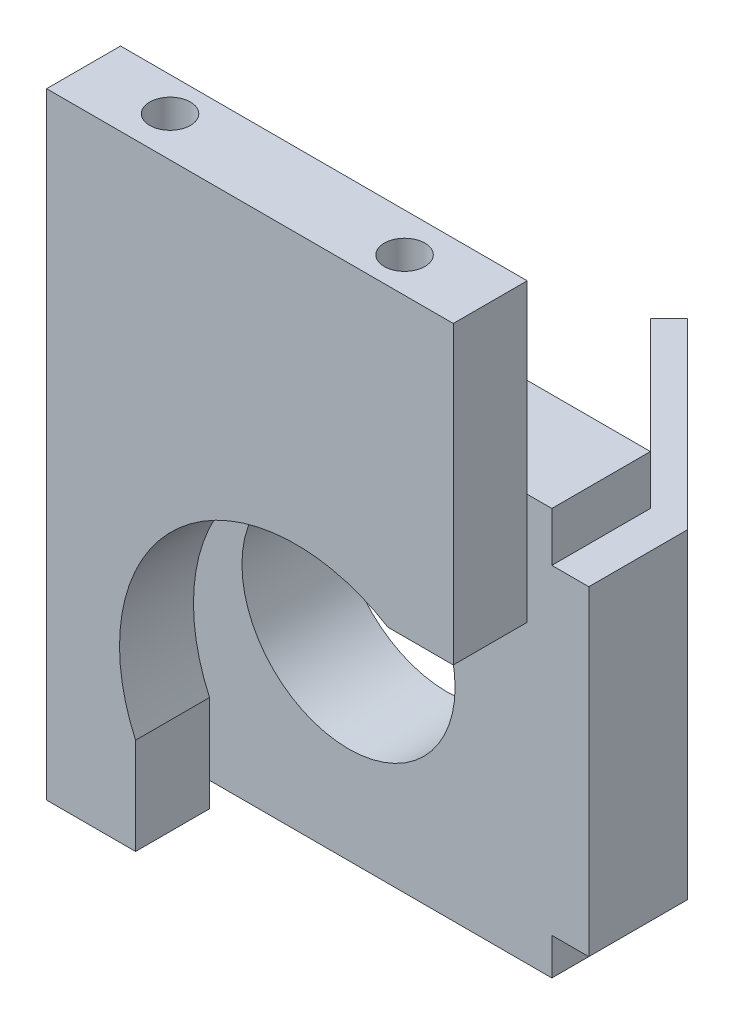
ISO-10303-21;
HEADER;
FILE_DESCRIPTION(('STEP AP214'),'2;1');
FILE_NAME('part.step','',(''),(''),'','','');
FILE_SCHEMA(('AUTOMOTIVE_DESIGN { 1 0 10303 214 1 1 1 1 }'));
ENDSEC;
DATA;
#1=APPLICATION_CONTEXT('core data for automotive mechanical design processes');
#2=APPLICATION_PROTOCOL_DEFINITION('international standard','automotive_design',2000,#1);
#3=PRODUCT_CONTEXT('',#1,'mechanical');
#4=PRODUCT('Part','Part','',(#3));
#5=PRODUCT_RELATED_PRODUCT_CATEGORY('part','',(#4));
#6=PRODUCT_DEFINITION_FORMATION('','',#4);
#7=PRODUCT_DEFINITION_CONTEXT('part definition',#1,'design');
#8=PRODUCT_DEFINITION('design','',#6,#7);
#9=PRODUCT_DEFINITION_SHAPE('','',#8);
#10=(LENGTH_UNIT() NAMED_UNIT(*) SI_UNIT(.MILLI.,.METRE.));
#11=(NAMED_UNIT(*) PLANE_ANGLE_UNIT() SI_UNIT($,.RADIAN.));
#12=(NAMED_UNIT(*) SI_UNIT($,.STERADIAN.) SOLID_ANGLE_UNIT());
#13=UNCERTAINTY_MEASURE_WITH_UNIT(LENGTH_MEASURE(1.E-05),#10,'distance_accuracy_value','');
#14=(GEOMETRIC_REPRESENTATION_CONTEXT(3) GLOBAL_UNCERTAINTY_ASSIGNED_CONTEXT((#13)) GLOBAL_UNIT_ASSIGNED_CONTEXT((#10,
#11,#12)) REPRESENTATION_CONTEXT('',''));
#15=CARTESIAN_POINT('',(0.,0.,0.));
#16=DIRECTION('',(0.,0.,1.));
#17=DIRECTION('',(1.,0.,0.));
#18=AXIS2_PLACEMENT_3D('',#15,#16,#17);
#19=CARTESIAN_POINT('',(0.,0.,0.));
#20=DIRECTION('',(0.,0.,-1.));
#21=DIRECTION('',(-1.,0.,0.));
#22=AXIS2_PLACEMENT_3D('',#19,#20,#21);
#23=PLANE('',#22);
#24=CARTESIAN_POINT('',(16.5,16.5,0.));
#25=DIRECTION('',(0.,0.,1.));
#26=DIRECTION('',(1.,0.,0.));
#27=AXIS2_PLACEMENT_3D('',#24,#25,#26);
#28=CIRCLE('',#27,8.65);
#29=CARTESIAN_POINT('',(25.15,16.5,0.));
#30=VERTEX_POINT('',#29);
#31=EDGE_CURVE('E248',#30,#30,#28,.T.);
#32=ORIENTED_EDGE('',*,*,#31,.T.);
#33=EDGE_LOOP('',(#32));
#34=FACE_BOUND('',#33,.T.);
#35=DIRECTION('',(0.,1.,0.));
#36=VECTOR('',#35,1.);
#37=CARTESIAN_POINT('',(33.,0.,0.));
#38=LINE('',#37,#36);
#39=CARTESIAN_POINT('',(33.,29.,0.));
#40=VERTEX_POINT('',#39);
#41=CARTESIAN_POINT('',(33.,33.,0.));
#42=VERTEX_POINT('',#41);
#43=EDGE_CURVE('E270',#40,#42,#38,.T.);
#44=ORIENTED_EDGE('',*,*,#43,.F.);
#45=DIRECTION('',(0.,-1.,0.));
#46=VECTOR('',#45,1.);
#47=CARTESIAN_POINT('',(33.,0.,0.));
#48=LINE('',#47,#46);
#49=CARTESIAN_POINT('',(33.,3.,0.));
#50=VERTEX_POINT('',#49);
#51=EDGE_CURVE('E219',#40,#50,#48,.T.);
#52=ORIENTED_EDGE('',*,*,#51,.T.);
#53=CARTESIAN_POINT('',(33.,0.,0.));
#54=VERTEX_POINT('',#53);
#55=EDGE_CURVE('E271',#54,#50,#38,.T.);
#56=ORIENTED_EDGE('',*,*,#55,.F.);
#57=DIRECTION('',(1.,0.,0.));
#58=VECTOR('',#57,1.);
#59=CARTESIAN_POINT('',(0.,0.,0.));
#60=LINE('',#59,#58);
#61=CARTESIAN_POINT('',(0.,0.,0.));
#62=VERTEX_POINT('',#61);
#63=EDGE_CURVE('E268',#62,#54,#60,.T.);
#64=ORIENTED_EDGE('',*,*,#63,.F.);
#65=DIRECTION('',(0.,-1.,0.));
#66=VECTOR('',#65,1.);
#67=CARTESIAN_POINT('',(0.,0.,0.));
#68=LINE('',#67,#66);
#69=CARTESIAN_POINT('',(0.,33.,0.));
#70=VERTEX_POINT('',#69);
#71=EDGE_CURVE('E252',#70,#62,#68,.T.);
#72=ORIENTED_EDGE('',*,*,#71,.F.);
#73=DIRECTION('',(-1.,0.,0.));
#74=VECTOR('',#73,1.);
#75=CARTESIAN_POINT('',(0.,33.,0.));
#76=LINE('',#75,#74);
#77=EDGE_CURVE('E259',#42,#70,#76,.T.);
#78=ORIENTED_EDGE('',*,*,#77,.F.);
#79=EDGE_LOOP('',(#44,#52,#56,#64,#72,#78));
#80=FACE_BOUND('',#79,.T.);
#81=ADVANCED_FACE('F34',(#34,#80),#23,.T.);
#82=CARTESIAN_POINT('',(33.,0.,8.));
#83=DIRECTION('',(-1.,0.,0.));
#84=DIRECTION('',(0.,0.,1.));
#85=AXIS2_PLACEMENT_3D('',#82,#83,#84);
#86=PLANE('',#85);
#87=DIRECTION('',(0.,0.,1.));
#88=VECTOR('',#87,1.);
#89=CARTESIAN_POINT('',(33.,29.,8.));
#90=LINE('',#89,#88);
#91=CARTESIAN_POINT('',(33.,29.,8.));
#92=VERTEX_POINT('',#91);
#93=EDGE_CURVE('E228',#40,#92,#90,.T.);
#94=ORIENTED_EDGE('',*,*,#93,.F.);
#95=ORIENTED_EDGE('',*,*,#43,.T.);
#96=DIRECTION('',(0.,0.,-1.));
#97=VECTOR('',#96,1.);
#98=CARTESIAN_POINT('',(33.,33.,8.));
#99=LINE('',#98,#97);
#100=CARTESIAN_POINT('',(33.,33.,8.));
#101=VERTEX_POINT('',#100);
#102=EDGE_CURVE('E276',#101,#42,#99,.T.);
#103=ORIENTED_EDGE('',*,*,#102,.F.);
#104=DIRECTION('',(0.,1.,0.));
#105=VECTOR('',#104,1.);
#106=CARTESIAN_POINT('',(33.,0.,8.));
#107=LINE('',#106,#105);
#108=EDGE_CURVE('E49',#92,#101,#107,.T.);
#109=ORIENTED_EDGE('',*,*,#108,.F.);
#110=EDGE_LOOP('',(#94,#95,#103,#109));
#111=FACE_BOUND('',#110,.T.);
#112=ADVANCED_FACE('F309',(#111),#86,.F.);
#113=DIRECTION('',(0.,0.,-1.));
#114=VECTOR('',#113,1.);
#115=CARTESIAN_POINT('',(33.,3.,8.));
#116=LINE('',#115,#114);
#117=CARTESIAN_POINT('',(33.,3.,8.));
#118=VERTEX_POINT('',#117);
#119=EDGE_CURVE('E57',#118,#50,#116,.T.);
#120=ORIENTED_EDGE('',*,*,#119,.F.);
#121=CARTESIAN_POINT('',(33.,0.,8.));
#122=VERTEX_POINT('',#121);
#123=EDGE_CURVE('E261',#122,#118,#107,.T.);
#124=ORIENTED_EDGE('',*,*,#123,.F.);
#125=DIRECTION('',(0.,0.,-1.));
#126=VECTOR('',#125,1.);
#127=CARTESIAN_POINT('',(33.,0.,8.));
#128=LINE('',#127,#126);
#129=EDGE_CURVE('E279',#122,#54,#128,.T.);
#130=ORIENTED_EDGE('',*,*,#129,.T.);
#131=ORIENTED_EDGE('',*,*,#55,.T.);
#132=EDGE_LOOP('',(#120,#124,#130,#131));
#133=FACE_BOUND('',#132,.T.);
#134=ADVANCED_FACE('F295',(#133),#86,.F.);
#135=CARTESIAN_POINT('',(0.,0.,8.));
#136=DIRECTION('',(0.,0.,-1.));
#137=DIRECTION('',(-1.,0.,0.));
#138=AXIS2_PLACEMENT_3D('',#135,#136,#137);
#139=PLANE('',#138);
#140=CARTESIAN_POINT('',(2.5,30.5,8.));
#141=DIRECTION('',(0.,0.,-1.));
#142=DIRECTION('',(-1.,0.,0.));
#143=AXIS2_PLACEMENT_3D('',#140,#141,#142);
#144=CIRCLE('',#143,1.5);
#145=CARTESIAN_POINT('',(1.,30.5,8.));
#146=VERTEX_POINT('',#145);
#147=EDGE_CURVE('E11',#146,#146,#144,.F.);
#148=ORIENTED_EDGE('',*,*,#147,.F.);
#149=EDGE_LOOP('',(#148));
#150=FACE_BOUND('',#149,.T.);
#151=DIRECTION('',(0.,-1.,0.));
#152=VECTOR('',#151,1.);
#153=CARTESIAN_POINT('',(0.,0.,8.));
#154=LINE('',#153,#152);
#155=CARTESIAN_POINT('',(0.,33.,8.));
#156=VERTEX_POINT('',#155);
#157=CARTESIAN_POINT('',(0.,0.,8.));
#158=VERTEX_POINT('',#157);
#159=EDGE_CURVE('E255',#156,#158,#154,.T.);
#160=ORIENTED_EDGE('',*,*,#159,.T.);
#161=DIRECTION('',(1.,0.,0.));
#162=VECTOR('',#161,1.);
#163=CARTESIAN_POINT('',(0.,0.,8.));
#164=LINE('',#163,#162);
#165=EDGE_CURVE('E258',#158,#122,#164,.T.);
#166=ORIENTED_EDGE('',*,*,#165,.T.);
#167=ORIENTED_EDGE('',*,*,#123,.T.);
#168=DIRECTION('',(-1.,0.,0.));
#169=VECTOR('',#168,1.);
#170=CARTESIAN_POINT('',(36.,3.,8.));
#171=LINE('',#170,#169);
#172=CARTESIAN_POINT('',(36.,3.,8.));
#173=VERTEX_POINT('',#172);
#174=EDGE_CURVE('E245',#173,#118,#171,.T.);
#175=ORIENTED_EDGE('',*,*,#174,.F.);
#176=DIRECTION('',(0.,-1.,0.));
#177=VECTOR('',#176,1.);
#178=CARTESIAN_POINT('',(36.,3.,8.));
#179=LINE('',#178,#177);
#180=CARTESIAN_POINT('',(36.,29.,8.));
#181=VERTEX_POINT('',#180);
#182=EDGE_CURVE('E224',#181,#173,#179,.T.);
#183=ORIENTED_EDGE('',*,*,#182,.F.);
#184=DIRECTION('',(-1.,0.,0.));
#185=VECTOR('',#184,1.);
#186=CARTESIAN_POINT('',(36.,29.,8.));
#187=LINE('',#186,#185);
#188=EDGE_CURVE('E234',#181,#92,#187,.T.);
#189=ORIENTED_EDGE('',*,*,#188,.T.);
#190=ORIENTED_EDGE('',*,*,#108,.T.);
#191=DIRECTION('',(-1.,0.,0.));
#192=VECTOR('',#191,1.);
#193=CARTESIAN_POINT('',(0.,33.,8.));
#194=LINE('',#193,#192);
#195=EDGE_CURVE('E263',#101,#156,#194,.T.);
#196=ORIENTED_EDGE('',*,*,#195,.T.);
#197=EDGE_LOOP('',(#160,#166,#167,#175,#183,#189,#190,#196));
#198=FACE_BOUND('',#197,.T.);
#199=CARTESIAN_POINT('',(16.5,16.5,8.));
#200=DIRECTION('',(0.,0.,1.));
#201=DIRECTION('',(1.,0.,0.));
#202=AXIS2_PLACEMENT_3D('',#199,#200,#201);
#203=CIRCLE('',#202,8.65);
#204=CARTESIAN_POINT('',(25.15,16.5,8.));
#205=VERTEX_POINT('',#204);
#206=EDGE_CURVE('E249',#205,#205,#203,.T.);
#207=ORIENTED_EDGE('',*,*,#206,.F.);
#208=EDGE_LOOP('',(#207));
#209=FACE_BOUND('',#208,.T.);
#210=ADVANCED_FACE('F304',(#150,#198,#209),#139,.F.);
#211=DIRECTION('',(0.,-1.,0.));
#212=VECTOR('',#211,1.);
#213=CARTESIAN_POINT('',(35.998132752231,0.,0.));
#214=LINE('',#213,#212);
#215=CARTESIAN_POINT('',(35.998132752231,29.,0.));
#216=VERTEX_POINT('',#215);
#217=CARTESIAN_POINT('',(35.998132752231,3.,0.));
#218=VERTEX_POINT('',#217);
#219=EDGE_CURVE('E222',#216,#218,#214,.T.);
#220=ORIENTED_EDGE('',*,*,#219,.F.);
#221=DIRECTION('',(-1.,0.,0.));
#222=VECTOR('',#221,1.);
#223=CARTESIAN_POINT('',(36.,29.,0.));
#224=LINE('',#223,#222);
#225=CARTESIAN_POINT('',(36.,29.,0.));
#226=VERTEX_POINT('',#225);
#227=EDGE_CURVE('E239',#226,#216,#224,.T.);
#228=ORIENTED_EDGE('',*,*,#227,.F.);
#229=DIRECTION('',(0.,1.,0.));
#230=VECTOR('',#229,1.);
#231=CARTESIAN_POINT('',(36.,3.,0.));
#232=LINE('',#231,#230);
#233=CARTESIAN_POINT('',(36.,3.,0.));
#234=VERTEX_POINT('',#233);
#235=EDGE_CURVE('E230',#234,#226,#232,.T.);
#236=ORIENTED_EDGE('',*,*,#235,.F.);
#237=DIRECTION('',(-1.,0.,0.));
#238=VECTOR('',#237,1.);
#239=CARTESIAN_POINT('',(36.,3.,0.));
#240=LINE('',#239,#238);
#241=EDGE_CURVE('E242',#234,#218,#240,.T.);
#242=ORIENTED_EDGE('',*,*,#241,.T.);
#243=EDGE_LOOP('',(#220,#228,#236,#242));
#244=FACE_BOUND('',#243,.T.);
#245=ADVANCED_FACE('F328',(#244),#23,.T.);
#246=CARTESIAN_POINT('',(0.,0.,8.));
#247=DIRECTION('',(1.,0.,0.));
#248=DIRECTION('',(0.,0.,-1.));
#249=AXIS2_PLACEMENT_3D('',#246,#247,#248);
#250=PLANE('',#249);
#251=ORIENTED_EDGE('',*,*,#71,.T.);
#252=DIRECTION('',(0.,0.,-1.));
#253=VECTOR('',#252,1.);
#254=CARTESIAN_POINT('',(0.,0.,8.));
#255=LINE('',#254,#253);
#256=EDGE_CURVE('E42',#158,#62,#255,.T.);
#257=ORIENTED_EDGE('',*,*,#256,.F.);
#258=ORIENTED_EDGE('',*,*,#159,.F.);
#259=DIRECTION('',(0.,0.,-1.));
#260=VECTOR('',#259,1.);
#261=CARTESIAN_POINT('',(0.,33.,8.));
#262=LINE('',#261,#260);
#263=EDGE_CURVE('E265',#156,#70,#262,.T.);
#264=ORIENTED_EDGE('',*,*,#263,.T.);
#265=EDGE_LOOP('',(#251,#257,#258,#264));
#266=FACE_BOUND('',#265,.T.);
#267=ADVANCED_FACE('F36',(#266),#250,.F.);
#268=CARTESIAN_POINT('',(0.,0.,8.));
#269=DIRECTION('',(0.,1.,0.));
#270=DIRECTION('',(0.,0.,1.));
#271=AXIS2_PLACEMENT_3D('',#268,#269,#270);
#272=PLANE('',#271);
#273=ORIENTED_EDGE('',*,*,#63,.T.);
#274=ORIENTED_EDGE('',*,*,#129,.F.);
#275=ORIENTED_EDGE('',*,*,#165,.F.);
#276=ORIENTED_EDGE('',*,*,#256,.T.);
#277=EDGE_LOOP('',(#273,#274,#275,#276));
#278=FACE_BOUND('',#277,.T.);
#279=ADVANCED_FACE('F284',(#278),#272,.F.);
#280=CARTESIAN_POINT('',(0.,33.,8.));
#281=DIRECTION('',(0.,-1.,0.));
#282=DIRECTION('',(0.,0.,-1.));
#283=AXIS2_PLACEMENT_3D('',#280,#281,#282);
#284=PLANE('',#283);
#285=ORIENTED_EDGE('',*,*,#77,.T.);
#286=ORIENTED_EDGE('',*,*,#263,.F.);
#287=ORIENTED_EDGE('',*,*,#195,.F.);
#288=ORIENTED_EDGE('',*,*,#102,.T.);
#289=EDGE_LOOP('',(#285,#286,#287,#288));
#290=FACE_BOUND('',#289,.T.);
#291=ADVANCED_FACE('F308',(#290),#284,.F.);
#292=CARTESIAN_POINT('',(16.5,16.5,8.));
#293=DIRECTION('',(0.,0.,-1.));
#294=DIRECTION('',(-1.,0.,0.));
#295=AXIS2_PLACEMENT_3D('',#292,#293,#294);
#296=CYLINDRICAL_SURFACE('',#295,8.65);
#297=ORIENTED_EDGE('',*,*,#206,.T.);
#298=EDGE_LOOP('',(#297));
#299=FACE_BOUND('',#298,.T.);
#300=ORIENTED_EDGE('',*,*,#31,.F.);
#301=EDGE_LOOP('',(#300));
#302=FACE_BOUND('',#301,.T.);
#303=ADVANCED_FACE('F370',(#299,#302),#296,.F.);
#304=CARTESIAN_POINT('',(36.,3.,8.));
#305=DIRECTION('',(0.,1.,0.));
#306=DIRECTION('',(0.,0.,1.));
#307=AXIS2_PLACEMENT_3D('',#304,#305,#306);
#308=PLANE('',#307);
#309=ORIENTED_EDGE('',*,*,#119,.T.);
#310=DIRECTION('',(-0.707106781186551,0.,-0.707106781186544));
#311=VECTOR('',#310,1.);
#312=CARTESIAN_POINT('',(34.5,3.,1.5));
#313=LINE('',#312,#311);
#314=CARTESIAN_POINT('',(19.6507575950824,3.,-13.3492424049174));
#315=VERTEX_POINT('',#314);
#316=EDGE_CURVE('E199',#50,#315,#313,.T.);
#317=ORIENTED_EDGE('',*,*,#316,.T.);
#318=DIRECTION('',(-0.707106781186544,0.,0.707106781186551));
#319=VECTOR('',#318,1.);
#320=CARTESIAN_POINT('',(21.1498239711979,3.,-14.8483087810329));
#321=LINE('',#320,#319);
#322=CARTESIAN_POINT('',(21.1498239711979,3.,-14.8483087810329));
#323=VERTEX_POINT('',#322);
#324=EDGE_CURVE('E216',#323,#315,#321,.T.);
#325=ORIENTED_EDGE('',*,*,#324,.F.);
#326=DIRECTION('',(-0.707106781186551,0.,-0.707106781186544));
#327=VECTOR('',#326,1.);
#328=CARTESIAN_POINT('',(35.9990663761155,3.,0.000933623884515934));
#329=LINE('',#328,#327);
#330=EDGE_CURVE('E202',#218,#323,#329,.T.);
#331=ORIENTED_EDGE('',*,*,#330,.F.);
#332=ORIENTED_EDGE('',*,*,#241,.F.);
#333=DIRECTION('',(0.,0.,-1.));
#334=VECTOR('',#333,1.);
#335=CARTESIAN_POINT('',(36.,3.,8.));
#336=LINE('',#335,#334);
#337=EDGE_CURVE('E227',#173,#234,#336,.T.);
#338=ORIENTED_EDGE('',*,*,#337,.F.);
#339=ORIENTED_EDGE('',*,*,#174,.T.);
#340=EDGE_LOOP('',(#309,#317,#325,#331,#332,#338,#339));
#341=FACE_BOUND('',#340,.T.);
#342=ADVANCED_FACE('F297',(#341),#308,.F.);
#343=CARTESIAN_POINT('',(36.,29.,8.));
#344=DIRECTION('',(0.,-1.,0.));
#345=DIRECTION('',(0.,0.,-1.));
#346=AXIS2_PLACEMENT_3D('',#343,#344,#345);
#347=PLANE('',#346);
#348=ORIENTED_EDGE('',*,*,#227,.T.);
#349=DIRECTION('',(0.707106781186551,0.,0.707106781186544));
#350=VECTOR('',#349,1.);
#351=CARTESIAN_POINT('',(35.9990663761155,29.,0.000933623884515934));
#352=LINE('',#351,#350);
#353=CARTESIAN_POINT('',(21.1498239711979,29.,-14.8483087810329));
#354=VERTEX_POINT('',#353);
#355=EDGE_CURVE('E207',#354,#216,#352,.T.);
#356=ORIENTED_EDGE('',*,*,#355,.F.);
#357=DIRECTION('',(-0.707106781186544,0.,0.707106781186551));
#358=VECTOR('',#357,1.);
#359=CARTESIAN_POINT('',(21.1498239711979,29.,-14.8483087810329));
#360=LINE('',#359,#358);
#361=CARTESIAN_POINT('',(19.6507575950824,29.,-13.3492424049174));
#362=VERTEX_POINT('',#361);
#363=EDGE_CURVE('E209',#354,#362,#360,.T.);
#364=ORIENTED_EDGE('',*,*,#363,.T.);
#365=DIRECTION('',(0.707106781186551,0.,0.707106781186544));
#366=VECTOR('',#365,1.);
#367=CARTESIAN_POINT('',(34.5,29.,1.5));
#368=LINE('',#367,#366);
#369=EDGE_CURVE('E205',#362,#40,#368,.T.);
#370=ORIENTED_EDGE('',*,*,#369,.T.);
#371=ORIENTED_EDGE('',*,*,#93,.T.);
#372=ORIENTED_EDGE('',*,*,#188,.F.);
#373=DIRECTION('',(0.,0.,1.));
#374=VECTOR('',#373,1.);
#375=CARTESIAN_POINT('',(36.,29.,8.));
#376=LINE('',#375,#374);
#377=EDGE_CURVE('E232',#226,#181,#376,.T.);
#378=ORIENTED_EDGE('',*,*,#377,.F.);
#379=EDGE_LOOP('',(#348,#356,#364,#370,#371,#372,#378));
#380=FACE_BOUND('',#379,.T.);
#381=ADVANCED_FACE('F312',(#380),#347,.F.);
#382=CARTESIAN_POINT('',(36.,0.,0.));
#383=DIRECTION('',(-1.,0.,0.));
#384=DIRECTION('',(0.,0.,1.));
#385=AXIS2_PLACEMENT_3D('',#382,#383,#384);
#386=PLANE('',#385);
#387=ORIENTED_EDGE('',*,*,#182,.T.);
#388=ORIENTED_EDGE('',*,*,#337,.T.);
#389=ORIENTED_EDGE('',*,*,#235,.T.);
#390=ORIENTED_EDGE('',*,*,#377,.T.);
#391=EDGE_LOOP('',(#387,#388,#389,#390));
#392=FACE_BOUND('',#391,.T.);
#393=ADVANCED_FACE('F331',(#392),#386,.F.);
#394=CARTESIAN_POINT('',(17.9990663761153,0.,-17.9990663761155));
#395=DIRECTION('',(0.707106781186544,0.,-0.707106781186551));
#396=DIRECTION('',(-0.707106781186551,0.,-0.707106781186544));
#397=AXIS2_PLACEMENT_3D('',#394,#395,#396);
#398=PLANE('',#397);
#399=ORIENTED_EDGE('',*,*,#355,.T.);
#400=ORIENTED_EDGE('',*,*,#219,.T.);
#401=ORIENTED_EDGE('',*,*,#330,.T.);
#402=DIRECTION('',(0.,1.,0.));
#403=VECTOR('',#402,1.);
#404=CARTESIAN_POINT('',(21.1498239711979,3.,-14.8483087810329));
#405=LINE('',#404,#403);
#406=EDGE_CURVE('E204',#323,#354,#405,.T.);
#407=ORIENTED_EDGE('',*,*,#406,.T.);
#408=EDGE_LOOP('',(#399,#400,#401,#407));
#409=FACE_BOUND('',#408,.T.);
#410=CARTESIAN_POINT('',(28.5744451736567,16.,-7.42368757857419));
#411=DIRECTION('',(0.707106781186544,0.,-0.707106781186551));
#412=DIRECTION('',(-0.707106781186551,0.,-0.707106781186544));
#413=AXIS2_PLACEMENT_3D('',#410,#411,#412);
#414=CIRCLE('',#413,8.1);
#415=CARTESIAN_POINT('',(22.8468802460456,16.,-13.1512525061852));
#416=VERTEX_POINT('',#415);
#417=EDGE_CURVE('E196',#416,#416,#414,.T.);
#418=ORIENTED_EDGE('',*,*,#417,.F.);
#419=EDGE_LOOP('',(#418));
#420=FACE_BOUND('',#419,.T.);
#421=ADVANCED_FACE('F332',(#409,#420),#398,.T.);
#422=CARTESIAN_POINT('',(16.4999999999998,0.,-16.5));
#423=DIRECTION('',(0.707106781186544,0.,-0.707106781186551));
#424=DIRECTION('',(-0.707106781186551,0.,-0.707106781186544));
#425=AXIS2_PLACEMENT_3D('',#422,#423,#424);
#426=PLANE('',#425);
#427=ORIENTED_EDGE('',*,*,#51,.F.);
#428=ORIENTED_EDGE('',*,*,#369,.F.);
#429=DIRECTION('',(0.,1.,0.));
#430=VECTOR('',#429,1.);
#431=CARTESIAN_POINT('',(19.6507575950824,3.,-13.3492424049174));
#432=LINE('',#431,#430);
#433=EDGE_CURVE('E211',#315,#362,#432,.T.);
#434=ORIENTED_EDGE('',*,*,#433,.F.);
#435=ORIENTED_EDGE('',*,*,#316,.F.);
#436=EDGE_LOOP('',(#427,#428,#434,#435));
#437=FACE_BOUND('',#436,.T.);
#438=CARTESIAN_POINT('',(27.0753787975412,16.,-5.9246212024587));
#439=DIRECTION('',(0.707106781186544,0.,-0.707106781186551));
#440=DIRECTION('',(-0.707106781186551,0.,-0.707106781186544));
#441=AXIS2_PLACEMENT_3D('',#438,#439,#440);
#442=CIRCLE('',#441,8.1);
#443=CARTESIAN_POINT('',(21.3478138699302,16.,-11.6521861300697));
#444=VERTEX_POINT('',#443);
#445=EDGE_CURVE('E190',#444,#444,#442,.T.);
#446=ORIENTED_EDGE('',*,*,#445,.T.);
#447=EDGE_LOOP('',(#446));
#448=FACE_BOUND('',#447,.T.);
#449=ADVANCED_FACE('F318',(#437,#448),#426,.F.);
#450=CARTESIAN_POINT('',(21.1498239711979,3.,-14.8483087810329));
#451=DIRECTION('',(0.707106781186551,0.,0.707106781186544));
#452=DIRECTION('',(0.707106781186544,0.,-0.707106781186551));
#453=AXIS2_PLACEMENT_3D('',#450,#451,#452);
#454=PLANE('',#453);
#455=ORIENTED_EDGE('',*,*,#433,.T.);
#456=ORIENTED_EDGE('',*,*,#363,.F.);
#457=ORIENTED_EDGE('',*,*,#406,.F.);
#458=ORIENTED_EDGE('',*,*,#324,.T.);
#459=EDGE_LOOP('',(#455,#456,#457,#458));
#460=FACE_BOUND('',#459,.T.);
#461=ADVANCED_FACE('F322',(#460),#454,.F.);
#462=CARTESIAN_POINT('',(28.5744451736567,16.,-7.42368757857419));
#463=DIRECTION('',(-0.707106781186544,0.,0.707106781186551));
#464=DIRECTION('',(0.707106781186551,0.,0.707106781186544));
#465=AXIS2_PLACEMENT_3D('',#462,#463,#464);
#466=CYLINDRICAL_SURFACE('',#465,8.1);
#467=ORIENTED_EDGE('',*,*,#417,.T.);
#468=EDGE_LOOP('',(#467));
#469=FACE_BOUND('',#468,.T.);
#470=ORIENTED_EDGE('',*,*,#445,.F.);
#471=EDGE_LOOP('',(#470));
#472=FACE_BOUND('',#471,.T.);
#473=ADVANCED_FACE('F338',(#469,#472),#466,.F.);
#474=CARTESIAN_POINT('',(2.5,30.5,10.));
#475=DIRECTION('',(0.,0.,-1.));
#476=DIRECTION('',(-1.,0.,0.));
#477=AXIS2_PLACEMENT_3D('',#474,#475,#476);
#478=CYLINDRICAL_SURFACE('',#477,1.5);
#479=CARTESIAN_POINT('',(2.5,30.5,10.));
#480=DIRECTION('',(0.,0.,1.));
#481=DIRECTION('',(1.,0.,0.));
#482=AXIS2_PLACEMENT_3D('',#479,#480,#481);
#483=CIRCLE('',#482,1.5);
#484=CARTESIAN_POINT('',(4.,30.5,10.));
#485=VERTEX_POINT('',#484);
#486=EDGE_CURVE('E187',#485,#485,#483,.T.);
#487=ORIENTED_EDGE('',*,*,#486,.F.);
#488=EDGE_LOOP('',(#487));
#489=FACE_BOUND('',#488,.T.);
#490=ORIENTED_EDGE('',*,*,#147,.T.);
#491=EDGE_LOOP('',(#490));
#492=FACE_BOUND('',#491,.T.);
#493=ADVANCED_FACE('F341',(#489,#492),#478,.T.);
#494=CARTESIAN_POINT('',(0.,0.,16.));
#495=DIRECTION('',(1.,0.,0.));
#496=DIRECTION('',(0.,0.,-1.));
#497=AXIS2_PLACEMENT_3D('',#494,#495,#496);
#498=PLANE('',#497);
#499=DIRECTION('',(0.,-1.,0.));
#500=VECTOR('',#499,1.);
#501=CARTESIAN_POINT('',(0.,0.,10.));
#502=LINE('',#501,#500);
#503=CARTESIAN_POINT('',(0.,50.,10.));
#504=VERTEX_POINT('',#503);
#505=CARTESIAN_POINT('',(0.,0.,10.));
#506=VERTEX_POINT('',#505);
#507=EDGE_CURVE('E186',#504,#506,#502,.T.);
#508=ORIENTED_EDGE('',*,*,#507,.T.);
#509=DIRECTION('',(0.,0.,-1.));
#510=VECTOR('',#509,1.);
#511=CARTESIAN_POINT('',(0.,0.,16.));
#512=LINE('',#511,#510);
#513=CARTESIAN_POINT('',(0.,0.,16.));
#514=VERTEX_POINT('',#513);
#515=EDGE_CURVE('E166',#514,#506,#512,.T.);
#516=ORIENTED_EDGE('',*,*,#515,.F.);
#517=DIRECTION('',(0.,-1.,0.));
#518=VECTOR('',#517,1.);
#519=CARTESIAN_POINT('',(0.,0.,16.));
#520=LINE('',#519,#518);
#521=CARTESIAN_POINT('',(0.,50.,16.));
#522=VERTEX_POINT('',#521);
#523=EDGE_CURVE('E173',#522,#514,#520,.T.);
#524=ORIENTED_EDGE('',*,*,#523,.F.);
#525=DIRECTION('',(0.,0.,-1.));
#526=VECTOR('',#525,1.);
#527=CARTESIAN_POINT('',(0.,50.,16.));
#528=LINE('',#527,#526);
#529=EDGE_CURVE('E640',#522,#504,#528,.T.);
#530=ORIENTED_EDGE('',*,*,#529,.T.);
#531=EDGE_LOOP('',(#508,#516,#524,#530));
#532=FACE_BOUND('',#531,.T.);
#533=ADVANCED_FACE('F184',(#532),#498,.F.);
#534=CARTESIAN_POINT('',(0.,0.,16.));
#535=DIRECTION('',(0.,1.,0.));
#536=DIRECTION('',(0.,0.,1.));
#537=AXIS2_PLACEMENT_3D('',#534,#535,#536);
#538=PLANE('',#537);
#539=DIRECTION('',(1.,0.,0.));
#540=VECTOR('',#539,1.);
#541=CARTESIAN_POINT('',(0.,0.,10.));
#542=LINE('',#541,#540);
#543=CARTESIAN_POINT('',(7.22,0.,10.));
#544=VERTEX_POINT('',#543);
#545=EDGE_CURVE('E622',#506,#544,#542,.T.);
#546=ORIENTED_EDGE('',*,*,#545,.T.);
#547=DIRECTION('',(0.,0.,-1.));
#548=VECTOR('',#547,1.);
#549=CARTESIAN_POINT('',(7.22,0.,16.));
#550=LINE('',#549,#548);
#551=CARTESIAN_POINT('',(7.22,0.,16.));
#552=VERTEX_POINT('',#551);
#553=EDGE_CURVE('E169',#552,#544,#550,.T.);
#554=ORIENTED_EDGE('',*,*,#553,.F.);
#555=DIRECTION('',(1.,0.,0.));
#556=VECTOR('',#555,1.);
#557=CARTESIAN_POINT('',(0.,0.,16.));
#558=LINE('',#557,#556);
#559=EDGE_CURVE('E162',#514,#552,#558,.T.);
#560=ORIENTED_EDGE('',*,*,#559,.F.);
#561=ORIENTED_EDGE('',*,*,#515,.T.);
#562=EDGE_LOOP('',(#546,#554,#560,#561));
#563=FACE_BOUND('',#562,.T.);
#564=ADVANCED_FACE('F164',(#563),#538,.F.);
#565=CARTESIAN_POINT('',(7.22,0.,16.));
#566=DIRECTION('',(-1.,0.,0.));
#567=DIRECTION('',(0.,-1.,0.));
#568=AXIS2_PLACEMENT_3D('',#565,#566,#567);
#569=PLANE('',#568);
#570=DIRECTION('',(0.,1.,0.));
#571=VECTOR('',#570,1.);
#572=CARTESIAN_POINT('',(7.22,0.,10.));
#573=LINE('',#572,#571);
#574=CARTESIAN_POINT('',(7.22,7.82318729639914,10.));
#575=VERTEX_POINT('',#574);
#576=EDGE_CURVE('E643',#544,#575,#573,.T.);
#577=ORIENTED_EDGE('',*,*,#576,.T.);
#578=DIRECTION('',(0.,0.,-1.));
#579=VECTOR('',#578,1.);
#580=CARTESIAN_POINT('',(7.22,7.82318729639914,16.));
#581=LINE('',#580,#579);
#582=CARTESIAN_POINT('',(7.22,7.82318729639914,16.));
#583=VERTEX_POINT('',#582);
#584=EDGE_CURVE('E192',#583,#575,#581,.T.);
#585=ORIENTED_EDGE('',*,*,#584,.F.);
#586=DIRECTION('',(0.,1.,0.));
#587=VECTOR('',#586,1.);
#588=CARTESIAN_POINT('',(7.22,0.,16.));
#589=LINE('',#588,#587);
#590=EDGE_CURVE('E172',#552,#583,#589,.T.);
#591=ORIENTED_EDGE('',*,*,#590,.F.);
#592=ORIENTED_EDGE('',*,*,#553,.T.);
#593=EDGE_LOOP('',(#577,#585,#591,#592));
#594=FACE_BOUND('',#593,.T.);
#595=ADVANCED_FACE('F496',(#594),#569,.F.);
#596=CARTESIAN_POINT('',(20.2306771925797,13.7874237852148,16.));
#597=DIRECTION('',(0.,0.,-1.));
#598=DIRECTION('',(-1.,0.,0.));
#599=AXIS2_PLACEMENT_3D('',#596,#597,#598);
#600=CYLINDRICAL_SURFACE('',#599,14.3125762147852);
#601=CARTESIAN_POINT('',(20.2306771925797,13.7874237852148,10.));
#602=DIRECTION('',(0.,0.,-1.));
#603=DIRECTION('',(-1.,0.,0.));
#604=AXIS2_PLACEMENT_3D('',#601,#602,#603);
#605=CIRCLE('',#604,14.3125762147852);
#606=CARTESIAN_POINT('',(27.6941093857532,26.,10.));
#607=VERTEX_POINT('',#606);
#608=EDGE_CURVE('E645',#575,#607,#605,.T.);
#609=ORIENTED_EDGE('',*,*,#608,.T.);
#610=DIRECTION('',(0.,0.,-1.));
#611=VECTOR('',#610,1.);
#612=CARTESIAN_POINT('',(27.6941093857532,26.,16.));
#613=LINE('',#612,#611);
#614=CARTESIAN_POINT('',(27.6941093857532,26.,16.));
#615=VERTEX_POINT('',#614);
#616=EDGE_CURVE('E659',#615,#607,#613,.T.);
#617=ORIENTED_EDGE('',*,*,#616,.F.);
#618=CARTESIAN_POINT('',(20.2306771925797,13.7874237852148,16.));
#619=DIRECTION('',(0.,0.,-1.));
#620=DIRECTION('',(-1.,0.,0.));
#621=AXIS2_PLACEMENT_3D('',#618,#619,#620);
#622=CIRCLE('',#621,14.3125762147852);
#623=EDGE_CURVE('E634',#583,#615,#622,.T.);
#624=ORIENTED_EDGE('',*,*,#623,.F.);
#625=ORIENTED_EDGE('',*,*,#584,.T.);
#626=EDGE_LOOP('',(#609,#617,#624,#625));
#627=FACE_BOUND('',#626,.T.);
#628=ADVANCED_FACE('F505',(#627),#600,.F.);
#629=CARTESIAN_POINT('',(33.,26.,16.));
#630=DIRECTION('',(0.,1.,0.));
#631=DIRECTION('',(-1.,0.,0.));
#632=AXIS2_PLACEMENT_3D('',#629,#630,#631);
#633=PLANE('',#632);
#634=DIRECTION('',(1.,0.,0.));
#635=VECTOR('',#634,1.);
#636=CARTESIAN_POINT('',(33.,26.,10.));
#637=LINE('',#636,#635);
#638=CARTESIAN_POINT('',(33.,26.,10.));
#639=VERTEX_POINT('',#638);
#640=EDGE_CURVE('E647',#607,#639,#637,.T.);
#641=ORIENTED_EDGE('',*,*,#640,.T.);
#642=DIRECTION('',(0.,0.,-1.));
#643=VECTOR('',#642,1.);
#644=CARTESIAN_POINT('',(33.,26.,16.));
#645=LINE('',#644,#643);
#646=CARTESIAN_POINT('',(33.,26.,16.));
#647=VERTEX_POINT('',#646);
#648=EDGE_CURVE('E656',#647,#639,#645,.T.);
#649=ORIENTED_EDGE('',*,*,#648,.F.);
#650=DIRECTION('',(1.,0.,0.));
#651=VECTOR('',#650,1.);
#652=CARTESIAN_POINT('',(33.,26.,16.));
#653=LINE('',#652,#651);
#654=EDGE_CURVE('E636',#615,#647,#653,.T.);
#655=ORIENTED_EDGE('',*,*,#654,.F.);
#656=ORIENTED_EDGE('',*,*,#616,.T.);
#657=EDGE_LOOP('',(#641,#649,#655,#656));
#658=FACE_BOUND('',#657,.T.);
#659=ADVANCED_FACE('F515',(#658),#633,.F.);
#660=CARTESIAN_POINT('',(33.,26.,16.));
#661=DIRECTION('',(-1.,0.,0.));
#662=DIRECTION('',(0.,0.,1.));
#663=AXIS2_PLACEMENT_3D('',#660,#661,#662);
#664=PLANE('',#663);
#665=DIRECTION('',(0.,1.,0.));
#666=VECTOR('',#665,1.);
#667=CARTESIAN_POINT('',(33.,26.,10.));
#668=LINE('',#667,#666);
#669=CARTESIAN_POINT('',(33.,50.,10.));
#670=VERTEX_POINT('',#669);
#671=EDGE_CURVE('E649',#639,#670,#668,.T.);
#672=ORIENTED_EDGE('',*,*,#671,.T.);
#673=DIRECTION('',(0.,0.,-1.));
#674=VECTOR('',#673,1.);
#675=CARTESIAN_POINT('',(33.,50.,16.));
#676=LINE('',#675,#674);
#677=CARTESIAN_POINT('',(33.,50.,16.));
#678=VERTEX_POINT('',#677);
#679=EDGE_CURVE('E653',#678,#670,#676,.T.);
#680=ORIENTED_EDGE('',*,*,#679,.F.);
#681=DIRECTION('',(0.,1.,0.));
#682=VECTOR('',#681,1.);
#683=CARTESIAN_POINT('',(33.,26.,16.));
#684=LINE('',#683,#682);
#685=EDGE_CURVE('E638',#647,#678,#684,.T.);
#686=ORIENTED_EDGE('',*,*,#685,.F.);
#687=ORIENTED_EDGE('',*,*,#648,.T.);
#688=EDGE_LOOP('',(#672,#680,#686,#687));
#689=FACE_BOUND('',#688,.T.);
#690=ADVANCED_FACE('F525',(#689),#664,.F.);
#691=CARTESIAN_POINT('',(0.,50.,16.));
#692=DIRECTION('',(0.,-1.,0.));
#693=DIRECTION('',(0.,0.,-1.));
#694=AXIS2_PLACEMENT_3D('',#691,#692,#693);
#695=PLANE('',#694);
#696=CARTESIAN_POINT('',(6.77,50.,12.75));
#697=DIRECTION('',(0.,1.,0.));
#698=DIRECTION('',(0.,0.,1.));
#699=AXIS2_PLACEMENT_3D('',#696,#697,#698);
#700=CIRCLE('',#699,1.65);
#701=CARTESIAN_POINT('',(6.77,50.,14.4));
#702=VERTEX_POINT('',#701);
#703=EDGE_CURVE('E620',#702,#702,#700,.T.);
#704=ORIENTED_EDGE('',*,*,#703,.F.);
#705=EDGE_LOOP('',(#704));
#706=FACE_BOUND('',#705,.T.);
#707=CARTESIAN_POINT('',(26.2,50.,13.15));
#708=DIRECTION('',(0.,1.,0.));
#709=DIRECTION('',(0.,0.,1.));
#710=AXIS2_PLACEMENT_3D('',#707,#708,#709);
#711=CIRCLE('',#710,1.65);
#712=CARTESIAN_POINT('',(26.2,50.,14.8));
#713=VERTEX_POINT('',#712);
#714=EDGE_CURVE('E630',#713,#713,#711,.T.);
#715=ORIENTED_EDGE('',*,*,#714,.F.);
#716=EDGE_LOOP('',(#715));
#717=FACE_BOUND('',#716,.T.);
#718=DIRECTION('',(-1.,0.,0.));
#719=VECTOR('',#718,1.);
#720=CARTESIAN_POINT('',(0.,50.,10.));
#721=LINE('',#720,#719);
#722=EDGE_CURVE('E182',#670,#504,#721,.T.);
#723=ORIENTED_EDGE('',*,*,#722,.T.);
#724=ORIENTED_EDGE('',*,*,#529,.F.);
#725=DIRECTION('',(-1.,0.,0.));
#726=VECTOR('',#725,1.);
#727=CARTESIAN_POINT('',(0.,50.,16.));
#728=LINE('',#727,#726);
#729=EDGE_CURVE('E178',#678,#522,#728,.T.);
#730=ORIENTED_EDGE('',*,*,#729,.F.);
#731=ORIENTED_EDGE('',*,*,#679,.T.);
#732=EDGE_LOOP('',(#723,#724,#730,#731));
#733=FACE_BOUND('',#732,.T.);
#734=ADVANCED_FACE('F535',(#706,#717,#733),#695,.F.);
#735=CARTESIAN_POINT('',(20.2306771925797,13.7874237852148,16.));
#736=DIRECTION('',(0.,0.,-1.));
#737=DIRECTION('',(-1.,0.,0.));
#738=AXIS2_PLACEMENT_3D('',#735,#736,#737);
#739=PLANE('',#738);
#740=ORIENTED_EDGE('',*,*,#523,.T.);
#741=ORIENTED_EDGE('',*,*,#559,.T.);
#742=ORIENTED_EDGE('',*,*,#590,.T.);
#743=ORIENTED_EDGE('',*,*,#623,.T.);
#744=ORIENTED_EDGE('',*,*,#654,.T.);
#745=ORIENTED_EDGE('',*,*,#685,.T.);
#746=ORIENTED_EDGE('',*,*,#729,.T.);
#747=EDGE_LOOP('',(#740,#741,#742,#743,#744,#745,#746));
#748=FACE_BOUND('',#747,.T.);
#749=ADVANCED_FACE('F176',(#748),#739,.F.);
#750=CARTESIAN_POINT('',(20.2306771925797,13.7874237852148,10.));
#751=DIRECTION('',(0.,0.,-1.));
#752=DIRECTION('',(-1.,0.,0.));
#753=AXIS2_PLACEMENT_3D('',#750,#751,#752);
#754=PLANE('',#753);
#755=ORIENTED_EDGE('',*,*,#486,.T.);
#756=EDGE_LOOP('',(#755));
#757=FACE_BOUND('',#756,.T.);
#758=ORIENTED_EDGE('',*,*,#507,.F.);
#759=ORIENTED_EDGE('',*,*,#722,.F.);
#760=ORIENTED_EDGE('',*,*,#671,.F.);
#761=ORIENTED_EDGE('',*,*,#640,.F.);
#762=ORIENTED_EDGE('',*,*,#608,.F.);
#763=ORIENTED_EDGE('',*,*,#576,.F.);
#764=ORIENTED_EDGE('',*,*,#545,.F.);
#765=EDGE_LOOP('',(#758,#759,#760,#761,#762,#763,#764));
#766=FACE_BOUND('',#765,.T.);
#767=ADVANCED_FACE('F547',(#757,#766),#754,.T.);
#768=CARTESIAN_POINT('',(26.2,40.,13.15));
#769=DIRECTION('',(0.,1.,0.));
#770=DIRECTION('',(0.,0.,1.));
#771=AXIS2_PLACEMENT_3D('',#768,#769,#770);
#772=CYLINDRICAL_SURFACE('',#771,1.65);
#773=CARTESIAN_POINT('',(26.2,40.,13.15));
#774=DIRECTION('',(0.,1.,0.));
#775=DIRECTION('',(0.,0.,1.));
#776=AXIS2_PLACEMENT_3D('',#773,#774,#775);
#777=CIRCLE('',#776,1.65);
#778=CARTESIAN_POINT('',(26.2,40.,14.8));
#779=VERTEX_POINT('',#778);
#780=EDGE_CURVE('E625',#779,#779,#777,.T.);
#781=ORIENTED_EDGE('',*,*,#780,.F.);
#782=EDGE_LOOP('',(#781));
#783=FACE_BOUND('',#782,.T.);
#784=ORIENTED_EDGE('',*,*,#714,.T.);
#785=EDGE_LOOP('',(#784));
#786=FACE_BOUND('',#785,.T.);
#787=ADVANCED_FACE('F557',(#783,#786),#772,.F.);
#788=CARTESIAN_POINT('',(26.2,40.,13.15));
#789=DIRECTION('',(0.,1.,0.));
#790=DIRECTION('',(0.,0.,1.));
#791=AXIS2_PLACEMENT_3D('',#788,#789,#790);
#792=PLANE('',#791);
#793=ORIENTED_EDGE('',*,*,#780,.T.);
#794=EDGE_LOOP('',(#793));
#795=FACE_BOUND('',#794,.T.);
#796=ADVANCED_FACE('F575',(#795),#792,.T.);
#797=CARTESIAN_POINT('',(6.77,40.,12.75));
#798=DIRECTION('',(0.,1.,0.));
#799=DIRECTION('',(0.,0.,1.));
#800=AXIS2_PLACEMENT_3D('',#797,#798,#799);
#801=CYLINDRICAL_SURFACE('',#800,1.65);
#802=CARTESIAN_POINT('',(6.77,40.,12.75));
#803=DIRECTION('',(0.,1.,0.));
#804=DIRECTION('',(0.,0.,1.));
#805=AXIS2_PLACEMENT_3D('',#802,#803,#804);
#806=CIRCLE('',#805,1.65);
#807=CARTESIAN_POINT('',(6.77,40.,14.4));
#808=VERTEX_POINT('',#807);
#809=EDGE_CURVE('E619',#808,#808,#806,.T.);
#810=ORIENTED_EDGE('',*,*,#809,.F.);
#811=EDGE_LOOP('',(#810));
#812=FACE_BOUND('',#811,.T.);
#813=ORIENTED_EDGE('',*,*,#703,.T.);
#814=EDGE_LOOP('',(#813));
#815=FACE_BOUND('',#814,.T.);
#816=ADVANCED_FACE('F586',(#812,#815),#801,.F.);
#817=CARTESIAN_POINT('',(6.77,40.,12.75));
#818=DIRECTION('',(0.,1.,0.));
#819=DIRECTION('',(0.,0.,1.));
#820=AXIS2_PLACEMENT_3D('',#817,#818,#819);
#821=PLANE('',#820);
#822=ORIENTED_EDGE('',*,*,#809,.T.);
#823=EDGE_LOOP('',(#822));
#824=FACE_BOUND('',#823,.T.);
#825=ADVANCED_FACE('F597',(#824),#821,.T.);
#826=CLOSED_SHELL('',(#81,#112,#134,#210,#245,#267,#279,#291,#303,#342,#381,#393,#421,#449,#461,
#473,#493,#533,#564,#595,#628,#659,#690,#734,#749,#767,#787,#796,#816,#825));
#827=MANIFOLD_SOLID_BREP('B2',#826);
#828=ADVANCED_BREP_SHAPE_REPRESENTATION('',(#18,#827),#14);
#829=SHAPE_DEFINITION_REPRESENTATION(#9,#828);
ENDSEC;
END-ISO-10303-21;
